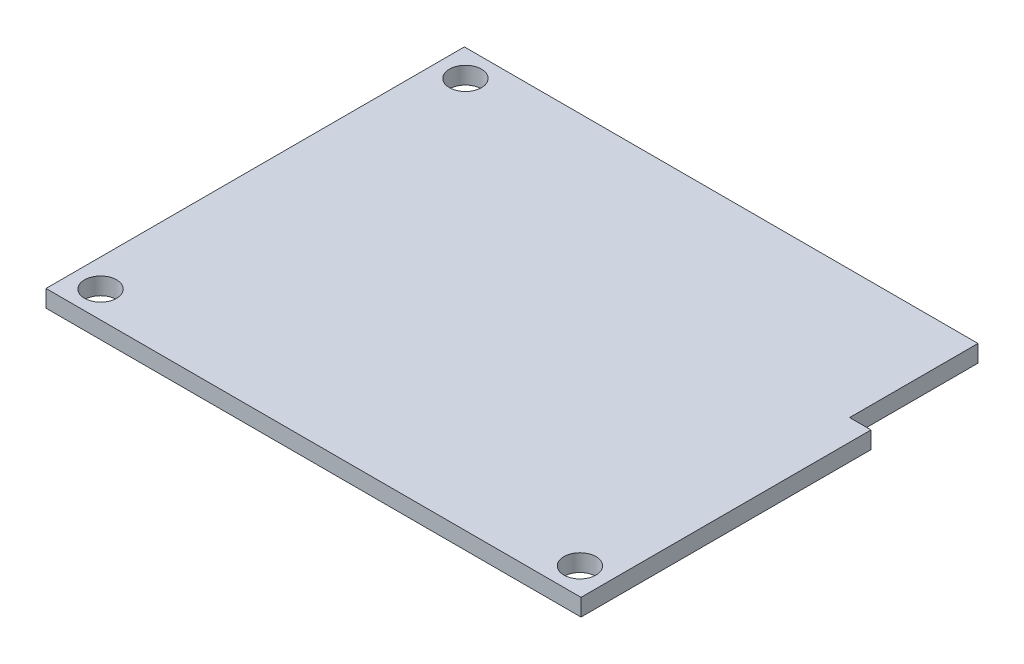
ISO-10303-21;
HEADER;
FILE_DESCRIPTION(('STEP AP214'),'2;1');
FILE_NAME('part.step','',(''),(''),'','','');
FILE_SCHEMA(('AUTOMOTIVE_DESIGN { 1 0 10303 214 1 1 1 1 }'));
ENDSEC;
DATA;
#1=APPLICATION_CONTEXT('core data for automotive mechanical design processes');
#2=APPLICATION_PROTOCOL_DEFINITION('international standard','automotive_design',2000,#1);
#3=PRODUCT_CONTEXT('',#1,'mechanical');
#4=PRODUCT('Part','Part','',(#3));
#5=PRODUCT_RELATED_PRODUCT_CATEGORY('part','',(#4));
#6=PRODUCT_DEFINITION_FORMATION('','',#4);
#7=PRODUCT_DEFINITION_CONTEXT('part definition',#1,'design');
#8=PRODUCT_DEFINITION('design','',#6,#7);
#9=PRODUCT_DEFINITION_SHAPE('','',#8);
#10=(LENGTH_UNIT() NAMED_UNIT(*) SI_UNIT(.MILLI.,.METRE.));
#11=(NAMED_UNIT(*) PLANE_ANGLE_UNIT() SI_UNIT($,.RADIAN.));
#12=(NAMED_UNIT(*) SI_UNIT($,.STERADIAN.) SOLID_ANGLE_UNIT());
#13=UNCERTAINTY_MEASURE_WITH_UNIT(LENGTH_MEASURE(1.E-05),#10,'distance_accuracy_value','');
#14=(GEOMETRIC_REPRESENTATION_CONTEXT(3) GLOBAL_UNCERTAINTY_ASSIGNED_CONTEXT((#13)) GLOBAL_UNIT_ASSIGNED_CONTEXT((#10,
#11,#12)) REPRESENTATION_CONTEXT('',''));
#15=CARTESIAN_POINT('',(0.,0.,0.));
#16=DIRECTION('',(0.,0.,1.));
#17=DIRECTION('',(1.,0.,0.));
#18=AXIS2_PLACEMENT_3D('',#15,#16,#17);
#19=CARTESIAN_POINT('',(0.,1.6,0.));
#20=DIRECTION('',(0.,-1.,0.));
#21=DIRECTION('',(0.,0.,-1.));
#22=AXIS2_PLACEMENT_3D('',#19,#20,#21);
#23=PLANE('',#22);
#24=DIRECTION('',(0.,0.,1.));
#25=VECTOR('',#24,1.);
#26=CARTESIAN_POINT('',(-25.,1.6,19.55));
#27=LINE('',#26,#25);
#28=CARTESIAN_POINT('',(-25.,1.6,-19.55));
#29=VERTEX_POINT('',#28);
#30=CARTESIAN_POINT('',(-25.,1.6,19.55));
#31=VERTEX_POINT('',#30);
#32=EDGE_CURVE('E152',#29,#31,#27,.T.);
#33=ORIENTED_EDGE('',*,*,#32,.T.);
#34=DIRECTION('',(1.,0.,0.));
#35=VECTOR('',#34,1.);
#36=CARTESIAN_POINT('',(-25.,1.6,19.55));
#37=LINE('',#36,#35);
#38=CARTESIAN_POINT('',(25.,1.6,19.55));
#39=VERTEX_POINT('',#38);
#40=EDGE_CURVE('E100',#31,#39,#37,.T.);
#41=ORIENTED_EDGE('',*,*,#40,.T.);
#42=DIRECTION('',(0.,0.,-1.));
#43=VECTOR('',#42,1.);
#44=CARTESIAN_POINT('',(25.,1.6,19.55));
#45=LINE('',#44,#43);
#46=CARTESIAN_POINT('',(25.,1.6,-7.55));
#47=VERTEX_POINT('',#46);
#48=EDGE_CURVE('E113',#39,#47,#45,.T.);
#49=ORIENTED_EDGE('',*,*,#48,.T.);
#50=DIRECTION('',(-1.,0.,0.));
#51=VECTOR('',#50,1.);
#52=CARTESIAN_POINT('',(23.,1.6,-7.55));
#53=LINE('',#52,#51);
#54=CARTESIAN_POINT('',(23.,1.6,-7.55));
#55=VERTEX_POINT('',#54);
#56=EDGE_CURVE('E107',#47,#55,#53,.T.);
#57=ORIENTED_EDGE('',*,*,#56,.T.);
#58=DIRECTION('',(0.,0.,-1.));
#59=VECTOR('',#58,1.);
#60=CARTESIAN_POINT('',(23.,1.6,-19.55));
#61=LINE('',#60,#59);
#62=CARTESIAN_POINT('',(23.,1.6,-19.55));
#63=VERTEX_POINT('',#62);
#64=EDGE_CURVE('E111',#55,#63,#61,.T.);
#65=ORIENTED_EDGE('',*,*,#64,.T.);
#66=DIRECTION('',(-1.,0.,0.));
#67=VECTOR('',#66,1.);
#68=CARTESIAN_POINT('',(-25.,1.6,-19.55));
#69=LINE('',#68,#67);
#70=EDGE_CURVE('E63',#63,#29,#69,.T.);
#71=ORIENTED_EDGE('',*,*,#70,.T.);
#72=EDGE_LOOP('',(#33,#41,#49,#57,#65,#71));
#73=FACE_BOUND('',#72,.T.);
#74=CARTESIAN_POINT('',(-22.4,1.6,-17.05));
#75=DIRECTION('',(0.,1.,0.));
#76=DIRECTION('',(0.,0.,1.));
#77=AXIS2_PLACEMENT_3D('',#74,#75,#76);
#78=CIRCLE('',#77,1.5);
#79=CARTESIAN_POINT('',(-22.4,1.6,-15.55));
#80=VERTEX_POINT('',#79);
#81=EDGE_CURVE('E140',#80,#80,#78,.T.);
#82=ORIENTED_EDGE('',*,*,#81,.F.);
#83=EDGE_LOOP('',(#82));
#84=FACE_BOUND('',#83,.T.);
#85=CARTESIAN_POINT('',(-22.4,1.6,17.05));
#86=DIRECTION('',(0.,1.,0.));
#87=DIRECTION('',(0.,0.,1.));
#88=AXIS2_PLACEMENT_3D('',#85,#86,#87);
#89=CIRCLE('',#88,1.5);
#90=CARTESIAN_POINT('',(-22.4,1.6,18.55));
#91=VERTEX_POINT('',#90);
#92=EDGE_CURVE('E212',#91,#91,#89,.T.);
#93=ORIENTED_EDGE('',*,*,#92,.F.);
#94=EDGE_LOOP('',(#93));
#95=FACE_BOUND('',#94,.T.);
#96=CARTESIAN_POINT('',(22.4,1.6,17.05));
#97=DIRECTION('',(0.,1.,0.));
#98=DIRECTION('',(0.,0.,1.));
#99=AXIS2_PLACEMENT_3D('',#96,#97,#98);
#100=CIRCLE('',#99,1.5);
#101=CARTESIAN_POINT('',(22.4,1.6,18.55));
#102=VERTEX_POINT('',#101);
#103=EDGE_CURVE('E201',#102,#102,#100,.T.);
#104=ORIENTED_EDGE('',*,*,#103,.F.);
#105=EDGE_LOOP('',(#104));
#106=FACE_BOUND('',#105,.T.);
#107=ADVANCED_FACE('F45',(#73,#84,#95,#106),#23,.F.);
#108=CARTESIAN_POINT('',(0.,0.,0.));
#109=DIRECTION('',(0.,-1.,0.));
#110=DIRECTION('',(0.,0.,-1.));
#111=AXIS2_PLACEMENT_3D('',#108,#109,#110);
#112=PLANE('',#111);
#113=CARTESIAN_POINT('',(-22.4,0.,17.05));
#114=DIRECTION('',(0.,1.,0.));
#115=DIRECTION('',(0.,0.,1.));
#116=AXIS2_PLACEMENT_3D('',#113,#114,#115);
#117=CIRCLE('',#116,1.5);
#118=CARTESIAN_POINT('',(-22.4,0.,18.55));
#119=VERTEX_POINT('',#118);
#120=EDGE_CURVE('E209',#119,#119,#117,.T.);
#121=ORIENTED_EDGE('',*,*,#120,.T.);
#122=EDGE_LOOP('',(#121));
#123=FACE_BOUND('',#122,.T.);
#124=DIRECTION('',(0.,0.,1.));
#125=VECTOR('',#124,1.);
#126=CARTESIAN_POINT('',(-25.,0.,19.55));
#127=LINE('',#126,#125);
#128=CARTESIAN_POINT('',(-25.,0.,-19.55));
#129=VERTEX_POINT('',#128);
#130=CARTESIAN_POINT('',(-25.,0.,19.55));
#131=VERTEX_POINT('',#130);
#132=EDGE_CURVE('E135',#129,#131,#127,.T.);
#133=ORIENTED_EDGE('',*,*,#132,.F.);
#134=DIRECTION('',(-1.,0.,0.));
#135=VECTOR('',#134,1.);
#136=CARTESIAN_POINT('',(-25.,0.,-19.55));
#137=LINE('',#136,#135);
#138=CARTESIAN_POINT('',(23.,0.,-19.55));
#139=VERTEX_POINT('',#138);
#140=EDGE_CURVE('E92',#139,#129,#137,.T.);
#141=ORIENTED_EDGE('',*,*,#140,.F.);
#142=DIRECTION('',(0.,0.,-1.));
#143=VECTOR('',#142,1.);
#144=CARTESIAN_POINT('',(23.,0.,-19.55));
#145=LINE('',#144,#143);
#146=CARTESIAN_POINT('',(23.,0.,-7.55));
#147=VERTEX_POINT('',#146);
#148=EDGE_CURVE('E86',#147,#139,#145,.T.);
#149=ORIENTED_EDGE('',*,*,#148,.F.);
#150=DIRECTION('',(-1.,0.,0.));
#151=VECTOR('',#150,1.);
#152=CARTESIAN_POINT('',(23.,0.,-7.55));
#153=LINE('',#152,#151);
#154=CARTESIAN_POINT('',(25.,0.,-7.55));
#155=VERTEX_POINT('',#154);
#156=EDGE_CURVE('E122',#155,#147,#153,.T.);
#157=ORIENTED_EDGE('',*,*,#156,.F.);
#158=DIRECTION('',(0.,0.,-1.));
#159=VECTOR('',#158,1.);
#160=CARTESIAN_POINT('',(25.,0.,19.55));
#161=LINE('',#160,#159);
#162=CARTESIAN_POINT('',(25.,0.,19.55));
#163=VERTEX_POINT('',#162);
#164=EDGE_CURVE('E143',#163,#155,#161,.T.);
#165=ORIENTED_EDGE('',*,*,#164,.F.);
#166=DIRECTION('',(1.,0.,0.));
#167=VECTOR('',#166,1.);
#168=CARTESIAN_POINT('',(-25.,0.,19.55));
#169=LINE('',#168,#167);
#170=EDGE_CURVE('E139',#131,#163,#169,.T.);
#171=ORIENTED_EDGE('',*,*,#170,.F.);
#172=EDGE_LOOP('',(#133,#141,#149,#157,#165,#171));
#173=FACE_BOUND('',#172,.T.);
#174=CARTESIAN_POINT('',(-22.4,0.,-17.05));
#175=DIRECTION('',(0.,1.,0.));
#176=DIRECTION('',(0.,0.,1.));
#177=AXIS2_PLACEMENT_3D('',#174,#175,#176);
#178=CIRCLE('',#177,1.5);
#179=CARTESIAN_POINT('',(-22.4,0.,-15.55));
#180=VERTEX_POINT('',#179);
#181=EDGE_CURVE('E216',#180,#180,#178,.T.);
#182=ORIENTED_EDGE('',*,*,#181,.T.);
#183=EDGE_LOOP('',(#182));
#184=FACE_BOUND('',#183,.T.);
#185=CARTESIAN_POINT('',(22.4,0.,17.05));
#186=DIRECTION('',(0.,1.,0.));
#187=DIRECTION('',(0.,0.,1.));
#188=AXIS2_PLACEMENT_3D('',#185,#186,#187);
#189=CIRCLE('',#188,1.5);
#190=CARTESIAN_POINT('',(22.4,0.,18.55));
#191=VERTEX_POINT('',#190);
#192=EDGE_CURVE('E204',#191,#191,#189,.T.);
#193=ORIENTED_EDGE('',*,*,#192,.T.);
#194=EDGE_LOOP('',(#193));
#195=FACE_BOUND('',#194,.T.);
#196=ADVANCED_FACE('F165',(#123,#173,#184,#195),#112,.T.);
#197=CARTESIAN_POINT('',(-25.,1.6,19.55));
#198=DIRECTION('',(1.,0.,0.));
#199=DIRECTION('',(0.,0.,-1.));
#200=AXIS2_PLACEMENT_3D('',#197,#198,#199);
#201=PLANE('',#200);
#202=ORIENTED_EDGE('',*,*,#132,.T.);
#203=DIRECTION('',(0.,-1.,0.));
#204=VECTOR('',#203,1.);
#205=CARTESIAN_POINT('',(-25.,1.6,19.55));
#206=LINE('',#205,#204);
#207=EDGE_CURVE('E11',#31,#131,#206,.T.);
#208=ORIENTED_EDGE('',*,*,#207,.F.);
#209=ORIENTED_EDGE('',*,*,#32,.F.);
#210=DIRECTION('',(0.,-1.,0.));
#211=VECTOR('',#210,1.);
#212=CARTESIAN_POINT('',(-25.,1.6,-19.55));
#213=LINE('',#212,#211);
#214=EDGE_CURVE('E131',#29,#129,#213,.T.);
#215=ORIENTED_EDGE('',*,*,#214,.T.);
#216=EDGE_LOOP('',(#202,#208,#209,#215));
#217=FACE_BOUND('',#216,.T.);
#218=ADVANCED_FACE('F47',(#217),#201,.F.);
#219=CARTESIAN_POINT('',(-25.,1.6,19.55));
#220=DIRECTION('',(0.,0.,-1.));
#221=DIRECTION('',(-1.,0.,0.));
#222=AXIS2_PLACEMENT_3D('',#219,#220,#221);
#223=PLANE('',#222);
#224=ORIENTED_EDGE('',*,*,#170,.T.);
#225=DIRECTION('',(0.,-1.,0.));
#226=VECTOR('',#225,1.);
#227=CARTESIAN_POINT('',(25.,1.6,19.55));
#228=LINE('',#227,#226);
#229=EDGE_CURVE('E55',#39,#163,#228,.T.);
#230=ORIENTED_EDGE('',*,*,#229,.F.);
#231=ORIENTED_EDGE('',*,*,#40,.F.);
#232=ORIENTED_EDGE('',*,*,#207,.T.);
#233=EDGE_LOOP('',(#224,#230,#231,#232));
#234=FACE_BOUND('',#233,.T.);
#235=ADVANCED_FACE('F276',(#234),#223,.F.);
#236=CARTESIAN_POINT('',(25.,1.6,19.55));
#237=DIRECTION('',(-1.,0.,0.));
#238=DIRECTION('',(0.,0.,1.));
#239=AXIS2_PLACEMENT_3D('',#236,#237,#238);
#240=PLANE('',#239);
#241=ORIENTED_EDGE('',*,*,#164,.T.);
#242=DIRECTION('',(0.,-1.,0.));
#243=VECTOR('',#242,1.);
#244=CARTESIAN_POINT('',(25.,1.6,-7.55));
#245=LINE('',#244,#243);
#246=EDGE_CURVE('E124',#47,#155,#245,.T.);
#247=ORIENTED_EDGE('',*,*,#246,.F.);
#248=ORIENTED_EDGE('',*,*,#48,.F.);
#249=ORIENTED_EDGE('',*,*,#229,.T.);
#250=EDGE_LOOP('',(#241,#247,#248,#249));
#251=FACE_BOUND('',#250,.T.);
#252=ADVANCED_FACE('F162',(#251),#240,.F.);
#253=CARTESIAN_POINT('',(23.,1.6,-7.55));
#254=DIRECTION('',(0.,0.,1.));
#255=DIRECTION('',(1.,0.,0.));
#256=AXIS2_PLACEMENT_3D('',#253,#254,#255);
#257=PLANE('',#256);
#258=ORIENTED_EDGE('',*,*,#156,.T.);
#259=DIRECTION('',(0.,-1.,0.));
#260=VECTOR('',#259,1.);
#261=CARTESIAN_POINT('',(23.,1.6,-7.55));
#262=LINE('',#261,#260);
#263=EDGE_CURVE('E119',#55,#147,#262,.T.);
#264=ORIENTED_EDGE('',*,*,#263,.F.);
#265=ORIENTED_EDGE('',*,*,#56,.F.);
#266=ORIENTED_EDGE('',*,*,#246,.T.);
#267=EDGE_LOOP('',(#258,#264,#265,#266));
#268=FACE_BOUND('',#267,.T.);
#269=ADVANCED_FACE('F120',(#268),#257,.F.);
#270=CARTESIAN_POINT('',(23.,1.6,-19.55));
#271=DIRECTION('',(-1.,0.,0.));
#272=DIRECTION('',(0.,0.,1.));
#273=AXIS2_PLACEMENT_3D('',#270,#271,#272);
#274=PLANE('',#273);
#275=ORIENTED_EDGE('',*,*,#148,.T.);
#276=DIRECTION('',(0.,-1.,0.));
#277=VECTOR('',#276,1.);
#278=CARTESIAN_POINT('',(23.,1.6,-19.55));
#279=LINE('',#278,#277);
#280=EDGE_CURVE('E125',#63,#139,#279,.T.);
#281=ORIENTED_EDGE('',*,*,#280,.F.);
#282=ORIENTED_EDGE('',*,*,#64,.F.);
#283=ORIENTED_EDGE('',*,*,#263,.T.);
#284=EDGE_LOOP('',(#275,#281,#282,#283));
#285=FACE_BOUND('',#284,.T.);
#286=ADVANCED_FACE('F127',(#285),#274,.F.);
#287=CARTESIAN_POINT('',(-25.,1.6,-19.55));
#288=DIRECTION('',(0.,0.,1.));
#289=DIRECTION('',(1.,0.,0.));
#290=AXIS2_PLACEMENT_3D('',#287,#288,#289);
#291=PLANE('',#290);
#292=ORIENTED_EDGE('',*,*,#140,.T.);
#293=ORIENTED_EDGE('',*,*,#214,.F.);
#294=ORIENTED_EDGE('',*,*,#70,.F.);
#295=ORIENTED_EDGE('',*,*,#280,.T.);
#296=EDGE_LOOP('',(#292,#293,#294,#295));
#297=FACE_BOUND('',#296,.T.);
#298=ADVANCED_FACE('F170',(#297),#291,.F.);
#299=CARTESIAN_POINT('',(-22.4,1.6,-17.05));
#300=DIRECTION('',(0.,-1.,0.));
#301=DIRECTION('',(0.,0.,-1.));
#302=AXIS2_PLACEMENT_3D('',#299,#300,#301);
#303=CYLINDRICAL_SURFACE('',#302,1.5);
#304=ORIENTED_EDGE('',*,*,#81,.T.);
#305=EDGE_LOOP('',(#304));
#306=FACE_BOUND('',#305,.T.);
#307=ORIENTED_EDGE('',*,*,#181,.F.);
#308=EDGE_LOOP('',(#307));
#309=FACE_BOUND('',#308,.T.);
#310=ADVANCED_FACE('F172',(#306,#309),#303,.F.);
#311=CARTESIAN_POINT('',(-22.4,1.6,17.05));
#312=DIRECTION('',(0.,-1.,0.));
#313=DIRECTION('',(0.,0.,-1.));
#314=AXIS2_PLACEMENT_3D('',#311,#312,#313);
#315=CYLINDRICAL_SURFACE('',#314,1.5);
#316=ORIENTED_EDGE('',*,*,#92,.T.);
#317=EDGE_LOOP('',(#316));
#318=FACE_BOUND('',#317,.T.);
#319=ORIENTED_EDGE('',*,*,#120,.F.);
#320=EDGE_LOOP('',(#319));
#321=FACE_BOUND('',#320,.T.);
#322=ADVANCED_FACE('F178',(#318,#321),#315,.F.);
#323=CARTESIAN_POINT('',(22.4,1.6,17.05));
#324=DIRECTION('',(0.,-1.,0.));
#325=DIRECTION('',(0.,0.,-1.));
#326=AXIS2_PLACEMENT_3D('',#323,#324,#325);
#327=CYLINDRICAL_SURFACE('',#326,1.5);
#328=ORIENTED_EDGE('',*,*,#103,.T.);
#329=EDGE_LOOP('',(#328));
#330=FACE_BOUND('',#329,.T.);
#331=ORIENTED_EDGE('',*,*,#192,.F.);
#332=EDGE_LOOP('',(#331));
#333=FACE_BOUND('',#332,.T.);
#334=ADVANCED_FACE('F192',(#330,#333),#327,.F.);
#335=CLOSED_SHELL('',(#107,#196,#218,#235,#252,#269,#286,#298,#310,#322,#334));
#336=MANIFOLD_SOLID_BREP('B2',#335);
#337=ADVANCED_BREP_SHAPE_REPRESENTATION('',(#18,#336),#14);
#338=SHAPE_DEFINITION_REPRESENTATION(#9,#337);
ENDSEC;
END-ISO-10303-21;
